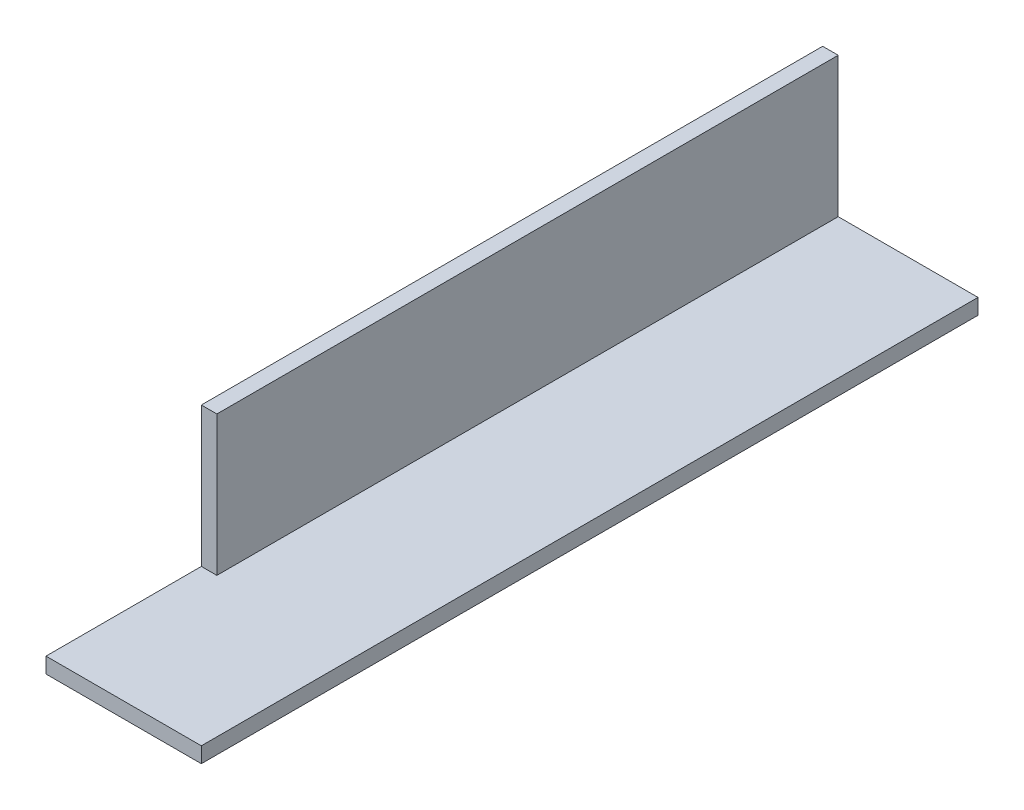
ISO-10303-21;
HEADER;
FILE_DESCRIPTION(('STEP AP214'),'2;1');
FILE_NAME('part.step','',(''),(''),'','','');
FILE_SCHEMA(('AUTOMOTIVE_DESIGN { 1 0 10303 214 1 1 1 1 }'));
ENDSEC;
DATA;
#1=APPLICATION_CONTEXT('core data for automotive mechanical design processes');
#2=APPLICATION_PROTOCOL_DEFINITION('international standard','automotive_design',2000,#1);
#3=PRODUCT_CONTEXT('',#1,'mechanical');
#4=PRODUCT('Part','Part','',(#3));
#5=PRODUCT_RELATED_PRODUCT_CATEGORY('part','',(#4));
#6=PRODUCT_DEFINITION_FORMATION('','',#4);
#7=PRODUCT_DEFINITION_CONTEXT('part definition',#1,'design');
#8=PRODUCT_DEFINITION('design','',#6,#7);
#9=PRODUCT_DEFINITION_SHAPE('','',#8);
#10=(LENGTH_UNIT() NAMED_UNIT(*) SI_UNIT(.MILLI.,.METRE.));
#11=(NAMED_UNIT(*) PLANE_ANGLE_UNIT() SI_UNIT($,.RADIAN.));
#12=(NAMED_UNIT(*) SI_UNIT($,.STERADIAN.) SOLID_ANGLE_UNIT());
#13=UNCERTAINTY_MEASURE_WITH_UNIT(LENGTH_MEASURE(1.E-05),#10,'distance_accuracy_value','');
#14=(GEOMETRIC_REPRESENTATION_CONTEXT(3) GLOBAL_UNCERTAINTY_ASSIGNED_CONTEXT((#13)) GLOBAL_UNIT_ASSIGNED_CONTEXT((#10,
#11,#12)) REPRESENTATION_CONTEXT('',''));
#15=CARTESIAN_POINT('',(0.,0.,0.));
#16=DIRECTION('',(0.,0.,1.));
#17=DIRECTION('',(1.,0.,0.));
#18=AXIS2_PLACEMENT_3D('',#15,#16,#17);
#19=CARTESIAN_POINT('',(0.,0.,100.));
#20=DIRECTION('',(0.,1.,0.));
#21=DIRECTION('',(0.,0.,1.));
#22=AXIS2_PLACEMENT_3D('',#19,#20,#21);
#23=PLANE('',#22);
#24=DIRECTION('',(1.,0.,0.));
#25=VECTOR('',#24,1.);
#26=CARTESIAN_POINT('',(0.,0.,0.));
#27=LINE('',#26,#25);
#28=CARTESIAN_POINT('',(0.,0.,0.));
#29=VERTEX_POINT('',#28);
#30=CARTESIAN_POINT('',(20.,0.,0.));
#31=VERTEX_POINT('',#30);
#32=EDGE_CURVE('E119',#29,#31,#27,.T.);
#33=ORIENTED_EDGE('',*,*,#32,.T.);
#34=DIRECTION('',(0.,0.,-1.));
#35=VECTOR('',#34,1.);
#36=CARTESIAN_POINT('',(20.,0.,100.));
#37=LINE('',#36,#35);
#38=CARTESIAN_POINT('',(20.,0.,100.));
#39=VERTEX_POINT('',#38);
#40=EDGE_CURVE('E11',#39,#31,#37,.T.);
#41=ORIENTED_EDGE('',*,*,#40,.F.);
#42=DIRECTION('',(1.,0.,0.));
#43=VECTOR('',#42,1.);
#44=CARTESIAN_POINT('',(0.,0.,100.));
#45=LINE('',#44,#43);
#46=CARTESIAN_POINT('',(0.,0.,100.));
#47=VERTEX_POINT('',#46);
#48=EDGE_CURVE('E121',#47,#39,#45,.T.);
#49=ORIENTED_EDGE('',*,*,#48,.F.);
#50=DIRECTION('',(0.,0.,-1.));
#51=VECTOR('',#50,1.);
#52=CARTESIAN_POINT('',(0.,0.,100.));
#53=LINE('',#52,#51);
#54=EDGE_CURVE('E126',#47,#29,#53,.T.);
#55=ORIENTED_EDGE('',*,*,#54,.T.);
#56=EDGE_LOOP('',(#33,#41,#49,#55));
#57=FACE_BOUND('',#56,.T.);
#58=ADVANCED_FACE('F33',(#57),#23,.F.);
#59=CARTESIAN_POINT('',(20.,2.,100.));
#60=DIRECTION('',(-1.,0.,0.));
#61=DIRECTION('',(0.,0.,1.));
#62=AXIS2_PLACEMENT_3D('',#59,#60,#61);
#63=PLANE('',#62);
#64=DIRECTION('',(0.,1.,0.));
#65=VECTOR('',#64,1.);
#66=CARTESIAN_POINT('',(20.,2.,0.));
#67=LINE('',#66,#65);
#68=CARTESIAN_POINT('',(20.,2.,0.));
#69=VERTEX_POINT('',#68);
#70=EDGE_CURVE('E129',#31,#69,#67,.T.);
#71=ORIENTED_EDGE('',*,*,#70,.T.);
#72=DIRECTION('',(0.,0.,-1.));
#73=VECTOR('',#72,1.);
#74=CARTESIAN_POINT('',(20.,2.,100.));
#75=LINE('',#74,#73);
#76=CARTESIAN_POINT('',(20.,2.,100.));
#77=VERTEX_POINT('',#76);
#78=EDGE_CURVE('E40',#77,#69,#75,.T.);
#79=ORIENTED_EDGE('',*,*,#78,.F.);
#80=DIRECTION('',(0.,1.,0.));
#81=VECTOR('',#80,1.);
#82=CARTESIAN_POINT('',(20.,2.,100.));
#83=LINE('',#82,#81);
#84=EDGE_CURVE('E83',#39,#77,#83,.T.);
#85=ORIENTED_EDGE('',*,*,#84,.F.);
#86=ORIENTED_EDGE('',*,*,#40,.T.);
#87=EDGE_LOOP('',(#71,#79,#85,#86));
#88=FACE_BOUND('',#87,.T.);
#89=ADVANCED_FACE('F171',(#88),#63,.F.);
#90=CARTESIAN_POINT('',(2.,2.,100.));
#91=DIRECTION('',(0.,-1.,0.));
#92=DIRECTION('',(0.,0.,-1.));
#93=AXIS2_PLACEMENT_3D('',#90,#91,#92);
#94=PLANE('',#93);
#95=DIRECTION('',(-1.,0.,0.));
#96=VECTOR('',#95,1.);
#97=CARTESIAN_POINT('',(2.,2.,0.));
#98=LINE('',#97,#96);
#99=CARTESIAN_POINT('',(2.,2.,0.));
#100=VERTEX_POINT('',#99);
#101=EDGE_CURVE('E131',#69,#100,#98,.T.);
#102=ORIENTED_EDGE('',*,*,#101,.T.);
#103=DIRECTION('',(0.,0.,-1.));
#104=VECTOR('',#103,1.);
#105=CARTESIAN_POINT('',(2.,2.,100.));
#106=LINE('',#105,#104);
#107=CARTESIAN_POINT('',(2.,2.,80.));
#108=VERTEX_POINT('',#107);
#109=EDGE_CURVE('E103',#108,#100,#106,.T.);
#110=ORIENTED_EDGE('',*,*,#109,.F.);
#111=DIRECTION('',(1.,0.,0.));
#112=VECTOR('',#111,1.);
#113=CARTESIAN_POINT('',(0.,2.,80.));
#114=LINE('',#113,#112);
#115=CARTESIAN_POINT('',(0.,2.,80.));
#116=VERTEX_POINT('',#115);
#117=EDGE_CURVE('E97',#116,#108,#114,.T.);
#118=ORIENTED_EDGE('',*,*,#117,.F.);
#119=DIRECTION('',(0.,0.,-1.));
#120=VECTOR('',#119,1.);
#121=CARTESIAN_POINT('',(0.,2.,100.));
#122=LINE('',#121,#120);
#123=CARTESIAN_POINT('',(0.,2.,100.));
#124=VERTEX_POINT('',#123);
#125=EDGE_CURVE('E102',#124,#116,#122,.T.);
#126=ORIENTED_EDGE('',*,*,#125,.F.);
#127=DIRECTION('',(-1.,0.,0.));
#128=VECTOR('',#127,1.);
#129=CARTESIAN_POINT('',(2.,2.,100.));
#130=LINE('',#129,#128);
#131=EDGE_CURVE('E47',#77,#124,#130,.T.);
#132=ORIENTED_EDGE('',*,*,#131,.F.);
#133=ORIENTED_EDGE('',*,*,#78,.T.);
#134=EDGE_LOOP('',(#102,#110,#118,#126,#132,#133));
#135=FACE_BOUND('',#134,.T.);
#136=ADVANCED_FACE('F100',(#135),#94,.F.);
#137=CARTESIAN_POINT('',(2.,2.,100.));
#138=DIRECTION('',(-1.,0.,0.));
#139=DIRECTION('',(0.,0.,1.));
#140=AXIS2_PLACEMENT_3D('',#137,#138,#139);
#141=PLANE('',#140);
#142=DIRECTION('',(0.,0.,-1.));
#143=VECTOR('',#142,1.);
#144=CARTESIAN_POINT('',(2.,20.,100.));
#145=LINE('',#144,#143);
#146=CARTESIAN_POINT('',(2.,20.,80.));
#147=VERTEX_POINT('',#146);
#148=CARTESIAN_POINT('',(2.,20.,0.));
#149=VERTEX_POINT('',#148);
#150=EDGE_CURVE('E143',#147,#149,#145,.T.);
#151=ORIENTED_EDGE('',*,*,#150,.F.);
#152=DIRECTION('',(0.,1.,0.));
#153=VECTOR('',#152,1.);
#154=CARTESIAN_POINT('',(2.,2.,80.));
#155=LINE('',#154,#153);
#156=EDGE_CURVE('E115',#108,#147,#155,.T.);
#157=ORIENTED_EDGE('',*,*,#156,.F.);
#158=ORIENTED_EDGE('',*,*,#109,.T.);
#159=DIRECTION('',(0.,1.,0.));
#160=VECTOR('',#159,1.);
#161=CARTESIAN_POINT('',(2.,2.,0.));
#162=LINE('',#161,#160);
#163=EDGE_CURVE('E133',#100,#149,#162,.T.);
#164=ORIENTED_EDGE('',*,*,#163,.T.);
#165=EDGE_LOOP('',(#151,#157,#158,#164));
#166=FACE_BOUND('',#165,.T.);
#167=ADVANCED_FACE('F154',(#166),#141,.F.);
#168=CARTESIAN_POINT('',(0.,20.,100.));
#169=DIRECTION('',(0.,-1.,0.));
#170=DIRECTION('',(0.,0.,-1.));
#171=AXIS2_PLACEMENT_3D('',#168,#169,#170);
#172=PLANE('',#171);
#173=DIRECTION('',(0.,0.,-1.));
#174=VECTOR('',#173,1.);
#175=CARTESIAN_POINT('',(0.,20.,100.));
#176=LINE('',#175,#174);
#177=CARTESIAN_POINT('',(0.,20.,80.));
#178=VERTEX_POINT('',#177);
#179=CARTESIAN_POINT('',(0.,20.,0.));
#180=VERTEX_POINT('',#179);
#181=EDGE_CURVE('E141',#178,#180,#176,.T.);
#182=ORIENTED_EDGE('',*,*,#181,.F.);
#183=DIRECTION('',(1.,0.,0.));
#184=VECTOR('',#183,1.);
#185=CARTESIAN_POINT('',(0.,20.,80.));
#186=LINE('',#185,#184);
#187=EDGE_CURVE('E106',#178,#147,#186,.T.);
#188=ORIENTED_EDGE('',*,*,#187,.T.);
#189=ORIENTED_EDGE('',*,*,#150,.T.);
#190=DIRECTION('',(-1.,0.,0.));
#191=VECTOR('',#190,1.);
#192=CARTESIAN_POINT('',(0.,20.,0.));
#193=LINE('',#192,#191);
#194=EDGE_CURVE('E136',#149,#180,#193,.T.);
#195=ORIENTED_EDGE('',*,*,#194,.T.);
#196=EDGE_LOOP('',(#182,#188,#189,#195));
#197=FACE_BOUND('',#196,.T.);
#198=ADVANCED_FACE('F156',(#197),#172,.F.);
#199=CARTESIAN_POINT('',(0.,0.,100.));
#200=DIRECTION('',(1.,0.,0.));
#201=DIRECTION('',(0.,0.,-1.));
#202=AXIS2_PLACEMENT_3D('',#199,#200,#201);
#203=PLANE('',#202);
#204=ORIENTED_EDGE('',*,*,#125,.T.);
#205=DIRECTION('',(0.,1.,0.));
#206=VECTOR('',#205,1.);
#207=CARTESIAN_POINT('',(0.,2.,80.));
#208=LINE('',#207,#206);
#209=EDGE_CURVE('E107',#116,#178,#208,.T.);
#210=ORIENTED_EDGE('',*,*,#209,.T.);
#211=ORIENTED_EDGE('',*,*,#181,.T.);
#212=DIRECTION('',(0.,-1.,0.));
#213=VECTOR('',#212,1.);
#214=CARTESIAN_POINT('',(0.,0.,0.));
#215=LINE('',#214,#213);
#216=EDGE_CURVE('E78',#180,#29,#215,.T.);
#217=ORIENTED_EDGE('',*,*,#216,.T.);
#218=ORIENTED_EDGE('',*,*,#54,.F.);
#219=DIRECTION('',(0.,-1.,0.));
#220=VECTOR('',#219,1.);
#221=CARTESIAN_POINT('',(0.,0.,100.));
#222=LINE('',#221,#220);
#223=EDGE_CURVE('E53',#124,#47,#222,.T.);
#224=ORIENTED_EDGE('',*,*,#223,.F.);
#225=EDGE_LOOP('',(#204,#210,#211,#217,#218,#224));
#226=FACE_BOUND('',#225,.T.);
#227=ADVANCED_FACE('F114',(#226),#203,.F.);
#228=CARTESIAN_POINT('',(0.,0.,100.));
#229=DIRECTION('',(0.,0.,-1.));
#230=DIRECTION('',(-1.,0.,0.));
#231=AXIS2_PLACEMENT_3D('',#228,#229,#230);
#232=PLANE('',#231);
#233=ORIENTED_EDGE('',*,*,#131,.T.);
#234=ORIENTED_EDGE('',*,*,#223,.T.);
#235=ORIENTED_EDGE('',*,*,#48,.T.);
#236=ORIENTED_EDGE('',*,*,#84,.T.);
#237=EDGE_LOOP('',(#233,#234,#235,#236));
#238=FACE_BOUND('',#237,.T.);
#239=ADVANCED_FACE('F160',(#238),#232,.F.);
#240=CARTESIAN_POINT('',(0.,0.,0.));
#241=DIRECTION('',(0.,0.,-1.));
#242=DIRECTION('',(-1.,0.,0.));
#243=AXIS2_PLACEMENT_3D('',#240,#241,#242);
#244=PLANE('',#243);
#245=ORIENTED_EDGE('',*,*,#32,.F.);
#246=ORIENTED_EDGE('',*,*,#216,.F.);
#247=ORIENTED_EDGE('',*,*,#194,.F.);
#248=ORIENTED_EDGE('',*,*,#163,.F.);
#249=ORIENTED_EDGE('',*,*,#101,.F.);
#250=ORIENTED_EDGE('',*,*,#70,.F.);
#251=EDGE_LOOP('',(#245,#246,#247,#248,#249,#250));
#252=FACE_BOUND('',#251,.T.);
#253=ADVANCED_FACE('F150',(#252),#244,.T.);
#254=CARTESIAN_POINT('',(0.,2.,80.));
#255=DIRECTION('',(0.,0.,-1.));
#256=DIRECTION('',(-1.,0.,0.));
#257=AXIS2_PLACEMENT_3D('',#254,#255,#256);
#258=PLANE('',#257);
#259=ORIENTED_EDGE('',*,*,#156,.T.);
#260=ORIENTED_EDGE('',*,*,#187,.F.);
#261=ORIENTED_EDGE('',*,*,#209,.F.);
#262=ORIENTED_EDGE('',*,*,#117,.T.);
#263=EDGE_LOOP('',(#259,#260,#261,#262));
#264=FACE_BOUND('',#263,.T.);
#265=ADVANCED_FACE('F110',(#264),#258,.F.);
#266=CLOSED_SHELL('',(#58,#89,#136,#167,#198,#227,#239,#253,#265));
#267=MANIFOLD_SOLID_BREP('B2',#266);
#268=ADVANCED_BREP_SHAPE_REPRESENTATION('',(#18,#267),#14);
#269=SHAPE_DEFINITION_REPRESENTATION(#9,#268);
ENDSEC;
END-ISO-10303-21;
